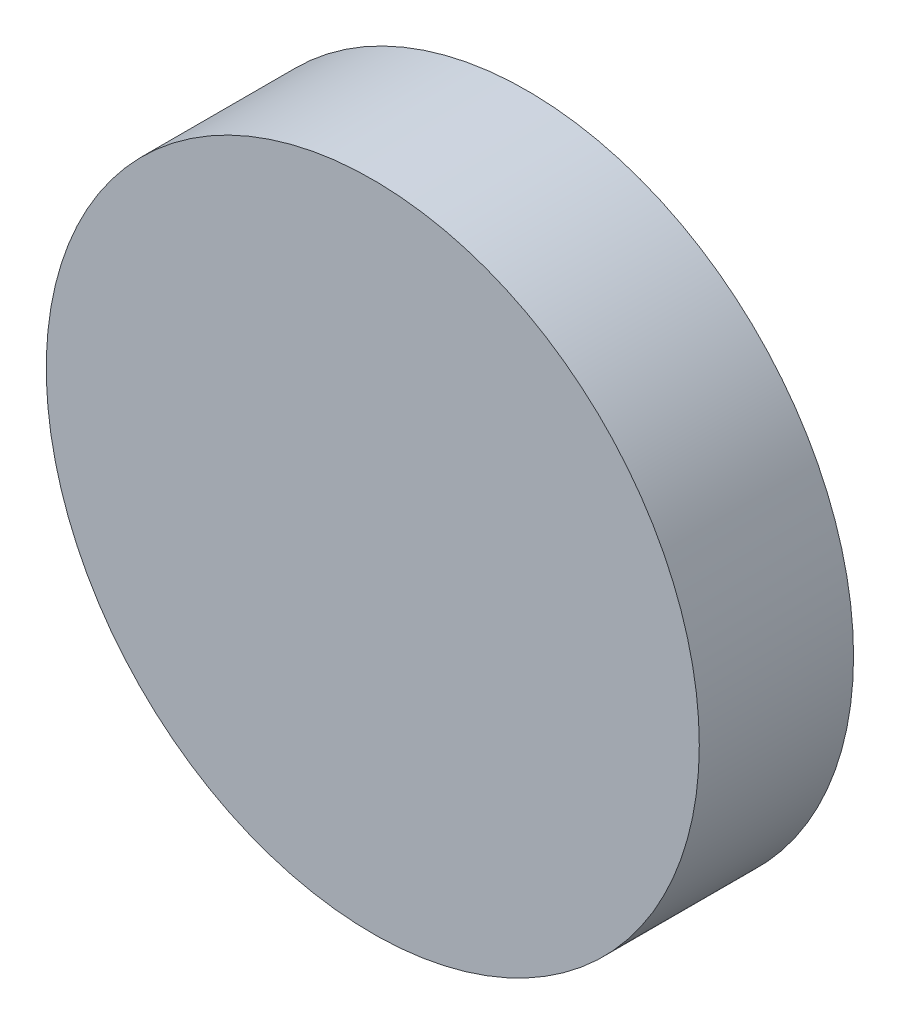
ISO-10303-21;
HEADER;
FILE_DESCRIPTION(('STEP AP214'),'2;1');
FILE_NAME('part.step','',(''),(''),'','','');
FILE_SCHEMA(('AUTOMOTIVE_DESIGN { 1 0 10303 214 1 1 1 1 }'));
ENDSEC;
DATA;
#1=APPLICATION_CONTEXT('core data for automotive mechanical design processes');
#2=APPLICATION_PROTOCOL_DEFINITION('international standard','automotive_design',2000,#1);
#3=PRODUCT_CONTEXT('',#1,'mechanical');
#4=PRODUCT('Part','Part','',(#3));
#5=PRODUCT_RELATED_PRODUCT_CATEGORY('part','',(#4));
#6=PRODUCT_DEFINITION_FORMATION('','',#4);
#7=PRODUCT_DEFINITION_CONTEXT('part definition',#1,'design');
#8=PRODUCT_DEFINITION('design','',#6,#7);
#9=PRODUCT_DEFINITION_SHAPE('','',#8);
#10=(LENGTH_UNIT() NAMED_UNIT(*) SI_UNIT(.MILLI.,.METRE.));
#11=(NAMED_UNIT(*) PLANE_ANGLE_UNIT() SI_UNIT($,.RADIAN.));
#12=(NAMED_UNIT(*) SI_UNIT($,.STERADIAN.) SOLID_ANGLE_UNIT());
#13=UNCERTAINTY_MEASURE_WITH_UNIT(LENGTH_MEASURE(1.E-05),#10,'distance_accuracy_value','');
#14=(GEOMETRIC_REPRESENTATION_CONTEXT(3) GLOBAL_UNCERTAINTY_ASSIGNED_CONTEXT((#13)) GLOBAL_UNIT_ASSIGNED_CONTEXT((#10,
#11,#12)) REPRESENTATION_CONTEXT('',''));
#15=CARTESIAN_POINT('',(0.,0.,0.));
#16=DIRECTION('',(0.,0.,1.));
#17=DIRECTION('',(1.,0.,0.));
#18=AXIS2_PLACEMENT_3D('',#15,#16,#17);
#19=CARTESIAN_POINT('',(0.,0.,3.));
#20=DIRECTION('',(0.,0.,-1.));
#21=DIRECTION('',(-1.,0.,0.));
#22=AXIS2_PLACEMENT_3D('',#19,#20,#21);
#23=CYLINDRICAL_SURFACE('',#22,6.35);
#24=CARTESIAN_POINT('',(0.,0.,3.));
#25=DIRECTION('',(0.,0.,1.));
#26=DIRECTION('',(1.,0.,0.));
#27=AXIS2_PLACEMENT_3D('',#24,#25,#26);
#28=CIRCLE('',#27,6.35);
#29=CARTESIAN_POINT('',(6.35,0.,3.));
#30=VERTEX_POINT('',#29);
#31=EDGE_CURVE('E10',#30,#30,#28,.T.);
#32=ORIENTED_EDGE('',*,*,#31,.F.);
#33=EDGE_LOOP('',(#32));
#34=FACE_BOUND('',#33,.T.);
#35=CARTESIAN_POINT('',(0.,0.,0.));
#36=DIRECTION('',(0.,0.,1.));
#37=DIRECTION('',(1.,0.,0.));
#38=AXIS2_PLACEMENT_3D('',#35,#36,#37);
#39=CIRCLE('',#38,6.35);
#40=CARTESIAN_POINT('',(6.35,0.,0.));
#41=VERTEX_POINT('',#40);
#42=EDGE_CURVE('E36',#41,#41,#39,.T.);
#43=ORIENTED_EDGE('',*,*,#42,.T.);
#44=EDGE_LOOP('',(#43));
#45=FACE_BOUND('',#44,.T.);
#46=ADVANCED_FACE('F33',(#34,#45),#23,.T.);
#47=CARTESIAN_POINT('',(0.,0.,3.));
#48=DIRECTION('',(0.,0.,1.));
#49=DIRECTION('',(1.,0.,0.));
#50=AXIS2_PLACEMENT_3D('',#47,#48,#49);
#51=PLANE('',#50);
#52=ORIENTED_EDGE('',*,*,#31,.T.);
#53=EDGE_LOOP('',(#52));
#54=FACE_BOUND('',#53,.T.);
#55=ADVANCED_FACE('F48',(#54),#51,.T.);
#56=CARTESIAN_POINT('',(0.,0.,0.));
#57=DIRECTION('',(0.,0.,1.));
#58=DIRECTION('',(1.,0.,0.));
#59=AXIS2_PLACEMENT_3D('',#56,#57,#58);
#60=PLANE('',#59);
#61=ORIENTED_EDGE('',*,*,#42,.F.);
#62=EDGE_LOOP('',(#61));
#63=FACE_BOUND('',#62,.T.);
#64=ADVANCED_FACE('F46',(#63),#60,.F.);
#65=CLOSED_SHELL('',(#46,#55,#64));
#66=MANIFOLD_SOLID_BREP('B2',#65);
#67=ADVANCED_BREP_SHAPE_REPRESENTATION('',(#18,#66),#14);
#68=SHAPE_DEFINITION_REPRESENTATION(#9,#67);
ENDSEC;
END-ISO-10303-21;
